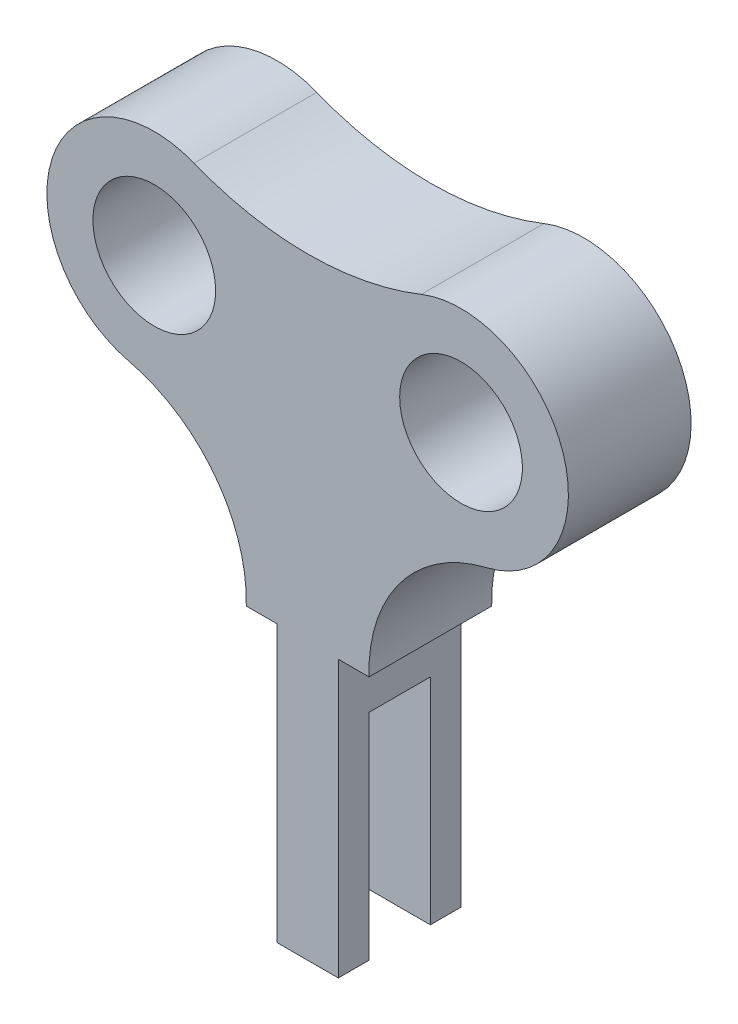
ISO-10303-21;
HEADER;
FILE_DESCRIPTION(('STEP AP214'),'2;1');
FILE_NAME('part.step','',(''),(''),'','','');
FILE_SCHEMA(('AUTOMOTIVE_DESIGN { 1 0 10303 214 1 1 1 1 }'));
ENDSEC;
DATA;
#1=APPLICATION_CONTEXT('core data for automotive mechanical design processes');
#2=APPLICATION_PROTOCOL_DEFINITION('international standard','automotive_design',2000,#1);
#3=PRODUCT_CONTEXT('',#1,'mechanical');
#4=PRODUCT('Part','Part','',(#3));
#5=PRODUCT_RELATED_PRODUCT_CATEGORY('part','',(#4));
#6=PRODUCT_DEFINITION_FORMATION('','',#4);
#7=PRODUCT_DEFINITION_CONTEXT('part definition',#1,'design');
#8=PRODUCT_DEFINITION('design','',#6,#7);
#9=PRODUCT_DEFINITION_SHAPE('','',#8);
#10=(LENGTH_UNIT() NAMED_UNIT(*) SI_UNIT(.MILLI.,.METRE.));
#11=(NAMED_UNIT(*) PLANE_ANGLE_UNIT() SI_UNIT($,.RADIAN.));
#12=(NAMED_UNIT(*) SI_UNIT($,.STERADIAN.) SOLID_ANGLE_UNIT());
#13=UNCERTAINTY_MEASURE_WITH_UNIT(LENGTH_MEASURE(1.E-05),#10,'distance_accuracy_value','');
#14=(GEOMETRIC_REPRESENTATION_CONTEXT(3) GLOBAL_UNCERTAINTY_ASSIGNED_CONTEXT((#13)) GLOBAL_UNIT_ASSIGNED_CONTEXT((#10,
#11,#12)) REPRESENTATION_CONTEXT('',''));
#15=CARTESIAN_POINT('',(0.,0.,0.));
#16=DIRECTION('',(0.,0.,1.));
#17=DIRECTION('',(1.,0.,0.));
#18=AXIS2_PLACEMENT_3D('',#15,#16,#17);
#19=CARTESIAN_POINT('',(-5.,-22.5,20.));
#20=DIRECTION('',(0.,1.,0.));
#21=DIRECTION('',(0.,0.,1.));
#22=AXIS2_PLACEMENT_3D('',#19,#20,#21);
#23=PLANE('',#22);
#24=DIRECTION('',(0.,0.,-1.));
#25=VECTOR('',#24,1.);
#26=CARTESIAN_POINT('',(-5.,-22.5,20.));
#27=LINE('',#26,#25);
#28=CARTESIAN_POINT('',(-5.,-22.5,20.));
#29=VERTEX_POINT('',#28);
#30=CARTESIAN_POINT('',(-5.,-22.5,15.));
#31=VERTEX_POINT('',#30);
#32=EDGE_CURVE('E145',#29,#31,#27,.T.);
#33=ORIENTED_EDGE('',*,*,#32,.T.);
#34=DIRECTION('',(1.,0.,0.));
#35=VECTOR('',#34,1.);
#36=CARTESIAN_POINT('',(-42.5,-22.5,15.));
#37=LINE('',#36,#35);
#38=CARTESIAN_POINT('',(5.,-22.5,15.));
#39=VERTEX_POINT('',#38);
#40=EDGE_CURVE('E269',#31,#39,#37,.T.);
#41=ORIENTED_EDGE('',*,*,#40,.T.);
#42=DIRECTION('',(0.,0.,-1.));
#43=VECTOR('',#42,1.);
#44=CARTESIAN_POINT('',(5.,-22.5,20.));
#45=LINE('',#44,#43);
#46=CARTESIAN_POINT('',(5.,-22.5,20.));
#47=VERTEX_POINT('',#46);
#48=EDGE_CURVE('E157',#47,#39,#45,.T.);
#49=ORIENTED_EDGE('',*,*,#48,.F.);
#50=DIRECTION('',(1.,0.,0.));
#51=VECTOR('',#50,1.);
#52=CARTESIAN_POINT('',(-5.,-22.5,20.));
#53=LINE('',#52,#51);
#54=EDGE_CURVE('E134',#29,#47,#53,.T.);
#55=ORIENTED_EDGE('',*,*,#54,.F.);
#56=EDGE_LOOP('',(#33,#41,#49,#55));
#57=FACE_BOUND('',#56,.T.);
#58=ADVANCED_FACE('F38',(#57),#23,.F.);
#59=CARTESIAN_POINT('',(5.,22.5,20.));
#60=DIRECTION('',(0.,1.,0.));
#61=DIRECTION('',(0.,0.,1.));
#62=AXIS2_PLACEMENT_3D('',#59,#60,#61);
#63=PLANE('',#62);
#64=DIRECTION('',(1.,0.,0.));
#65=VECTOR('',#64,1.);
#66=CARTESIAN_POINT('',(5.,22.5,0.));
#67=LINE('',#66,#65);
#68=CARTESIAN_POINT('',(5.,22.5,0.));
#69=VERTEX_POINT('',#68);
#70=CARTESIAN_POINT('',(10.,22.5,0.));
#71=VERTEX_POINT('',#70);
#72=EDGE_CURVE('E165',#69,#71,#67,.T.);
#73=ORIENTED_EDGE('',*,*,#72,.T.);
#74=DIRECTION('',(0.,0.,-1.));
#75=VECTOR('',#74,1.);
#76=CARTESIAN_POINT('',(10.,22.5,20.));
#77=LINE('',#76,#75);
#78=CARTESIAN_POINT('',(10.,22.5,20.));
#79=VERTEX_POINT('',#78);
#80=EDGE_CURVE('E11',#79,#71,#77,.T.);
#81=ORIENTED_EDGE('',*,*,#80,.F.);
#82=DIRECTION('',(1.,0.,0.));
#83=VECTOR('',#82,1.);
#84=CARTESIAN_POINT('',(5.,22.5,20.));
#85=LINE('',#84,#83);
#86=CARTESIAN_POINT('',(5.,22.5,20.));
#87=VERTEX_POINT('',#86);
#88=EDGE_CURVE('E197',#87,#79,#85,.T.);
#89=ORIENTED_EDGE('',*,*,#88,.F.);
#90=DIRECTION('',(0.,0.,-1.));
#91=VECTOR('',#90,1.);
#92=CARTESIAN_POINT('',(5.,22.5,20.));
#93=LINE('',#92,#91);
#94=EDGE_CURVE('E161',#87,#69,#93,.T.);
#95=ORIENTED_EDGE('',*,*,#94,.T.);
#96=EDGE_LOOP('',(#73,#81,#89,#95));
#97=FACE_BOUND('',#96,.T.);
#98=ADVANCED_FACE('F40',(#97),#63,.F.);
#99=CARTESIAN_POINT('',(34.990451034251,23.1909103449104,20.));
#100=DIRECTION('',(0.,0.,-1.));
#101=DIRECTION('',(-1.,0.,0.));
#102=AXIS2_PLACEMENT_3D('',#99,#100,#101);
#103=CYLINDRICAL_SURFACE('',#102,25.);
#104=CARTESIAN_POINT('',(34.990451034251,23.1909103449104,0.));
#105=DIRECTION('',(0.,0.,-1.));
#106=DIRECTION('',(1.,0.,0.));
#107=AXIS2_PLACEMENT_3D('',#104,#105,#106);
#108=CIRCLE('',#107,25.);
#109=CARTESIAN_POINT('',(29.1137151317504,47.4903748479043,0.));
#110=VERTEX_POINT('',#109);
#111=EDGE_CURVE('E169',#71,#110,#108,.T.);
#112=ORIENTED_EDGE('',*,*,#111,.T.);
#113=DIRECTION('',(0.,0.,-1.));
#114=VECTOR('',#113,1.);
#115=CARTESIAN_POINT('',(29.1137151317504,47.4903748479043,20.));
#116=LINE('',#115,#114);
#117=CARTESIAN_POINT('',(29.1137151317504,47.4903748479043,20.));
#118=VERTEX_POINT('',#117);
#119=EDGE_CURVE('E47',#118,#110,#116,.T.);
#120=ORIENTED_EDGE('',*,*,#119,.F.);
#121=CARTESIAN_POINT('',(34.990451034251,23.1909103449104,20.));
#122=DIRECTION('',(0.,0.,-1.));
#123=DIRECTION('',(1.,0.,0.));
#124=AXIS2_PLACEMENT_3D('',#121,#122,#123);
#125=CIRCLE('',#124,25.);
#126=EDGE_CURVE('E109',#79,#118,#125,.T.);
#127=ORIENTED_EDGE('',*,*,#126,.F.);
#128=ORIENTED_EDGE('',*,*,#80,.T.);
#129=EDGE_LOOP('',(#112,#120,#127,#128));
#130=FACE_BOUND('',#129,.T.);
#131=ADVANCED_FACE('F342',(#130),#103,.F.);
#132=CARTESIAN_POINT('',(25.,64.5,20.));
#133=DIRECTION('',(0.,0.,-1.));
#134=DIRECTION('',(-1.,0.,0.));
#135=AXIS2_PLACEMENT_3D('',#132,#133,#134);
#136=CYLINDRICAL_SURFACE('',#135,17.5);
#137=CARTESIAN_POINT('',(25.,64.5,0.));
#138=DIRECTION('',(0.,0.,1.));
#139=DIRECTION('',(1.,0.,0.));
#140=AXIS2_PLACEMENT_3D('',#137,#138,#139);
#141=CIRCLE('',#140,17.5);
#142=CARTESIAN_POINT('',(18.5185185185185,80.7554728570169,0.));
#143=VERTEX_POINT('',#142);
#144=EDGE_CURVE('E172',#110,#143,#141,.T.);
#145=ORIENTED_EDGE('',*,*,#144,.T.);
#146=DIRECTION('',(0.,0.,-1.));
#147=VECTOR('',#146,1.);
#148=CARTESIAN_POINT('',(18.5185185185185,80.7554728570169,20.));
#149=LINE('',#148,#147);
#150=CARTESIAN_POINT('',(18.5185185185185,80.7554728570169,20.));
#151=VERTEX_POINT('',#150);
#152=EDGE_CURVE('E217',#151,#143,#149,.T.);
#153=ORIENTED_EDGE('',*,*,#152,.F.);
#154=CARTESIAN_POINT('',(25.,64.5,20.));
#155=DIRECTION('',(0.,0.,1.));
#156=DIRECTION('',(1.,0.,0.));
#157=AXIS2_PLACEMENT_3D('',#154,#155,#156);
#158=CIRCLE('',#157,17.5);
#159=EDGE_CURVE('E227',#118,#151,#158,.T.);
#160=ORIENTED_EDGE('',*,*,#159,.F.);
#161=ORIENTED_EDGE('',*,*,#119,.T.);
#162=EDGE_LOOP('',(#145,#153,#160,#161));
#163=FACE_BOUND('',#162,.T.);
#164=ADVANCED_FACE('F225',(#163),#136,.T.);
#165=CARTESIAN_POINT('',(0.,127.199681019922,20.));
#166=DIRECTION('',(0.,0.,-1.));
#167=DIRECTION('',(-1.,0.,0.));
#168=AXIS2_PLACEMENT_3D('',#165,#166,#167);
#169=CYLINDRICAL_SURFACE('',#168,50.);
#170=CARTESIAN_POINT('',(0.,127.199681019922,0.));
#171=DIRECTION('',(0.,0.,-1.));
#172=DIRECTION('',(1.,0.,0.));
#173=AXIS2_PLACEMENT_3D('',#170,#171,#172);
#174=CIRCLE('',#173,50.);
#175=CARTESIAN_POINT('',(-18.5185185185185,80.7554728570169,0.));
#176=VERTEX_POINT('',#175);
#177=EDGE_CURVE('E175',#143,#176,#174,.T.);
#178=ORIENTED_EDGE('',*,*,#177,.T.);
#179=DIRECTION('',(0.,0.,-1.));
#180=VECTOR('',#179,1.);
#181=CARTESIAN_POINT('',(-18.5185185185185,80.7554728570169,20.));
#182=LINE('',#181,#180);
#183=CARTESIAN_POINT('',(-18.5185185185185,80.7554728570169,20.));
#184=VERTEX_POINT('',#183);
#185=EDGE_CURVE('E213',#184,#176,#182,.T.);
#186=ORIENTED_EDGE('',*,*,#185,.F.);
#187=CARTESIAN_POINT('',(0.,127.199681019922,20.));
#188=DIRECTION('',(0.,0.,-1.));
#189=DIRECTION('',(1.,0.,0.));
#190=AXIS2_PLACEMENT_3D('',#187,#188,#189);
#191=CIRCLE('',#190,50.);
#192=EDGE_CURVE('E246',#151,#184,#191,.T.);
#193=ORIENTED_EDGE('',*,*,#192,.F.);
#194=ORIENTED_EDGE('',*,*,#152,.T.);
#195=EDGE_LOOP('',(#178,#186,#193,#194));
#196=FACE_BOUND('',#195,.T.);
#197=ADVANCED_FACE('F236',(#196),#169,.F.);
#198=CARTESIAN_POINT('',(-25.,64.5,20.));
#199=DIRECTION('',(0.,0.,-1.));
#200=DIRECTION('',(-1.,0.,0.));
#201=AXIS2_PLACEMENT_3D('',#198,#199,#200);
#202=CYLINDRICAL_SURFACE('',#201,17.5);
#203=CARTESIAN_POINT('',(-25.,64.5,0.));
#204=DIRECTION('',(0.,0.,1.));
#205=DIRECTION('',(1.,0.,0.));
#206=AXIS2_PLACEMENT_3D('',#203,#204,#205);
#207=CIRCLE('',#206,17.5);
#208=CARTESIAN_POINT('',(-29.1137151317504,47.4903748479043,0.));
#209=VERTEX_POINT('',#208);
#210=EDGE_CURVE('E178',#176,#209,#207,.T.);
#211=ORIENTED_EDGE('',*,*,#210,.T.);
#212=DIRECTION('',(0.,0.,-1.));
#213=VECTOR('',#212,1.);
#214=CARTESIAN_POINT('',(-29.1137151317504,47.4903748479043,20.));
#215=LINE('',#214,#213);
#216=CARTESIAN_POINT('',(-29.1137151317504,47.4903748479043,20.));
#217=VERTEX_POINT('',#216);
#218=EDGE_CURVE('E209',#217,#209,#215,.T.);
#219=ORIENTED_EDGE('',*,*,#218,.F.);
#220=CARTESIAN_POINT('',(-25.,64.5,20.));
#221=DIRECTION('',(0.,0.,1.));
#222=DIRECTION('',(1.,0.,0.));
#223=AXIS2_PLACEMENT_3D('',#220,#221,#222);
#224=CIRCLE('',#223,17.5);
#225=EDGE_CURVE('E242',#184,#217,#224,.T.);
#226=ORIENTED_EDGE('',*,*,#225,.F.);
#227=ORIENTED_EDGE('',*,*,#185,.T.);
#228=EDGE_LOOP('',(#211,#219,#226,#227));
#229=FACE_BOUND('',#228,.T.);
#230=ADVANCED_FACE('F240',(#229),#202,.T.);
#231=CARTESIAN_POINT('',(-34.990451034251,23.1909103449104,20.));
#232=DIRECTION('',(0.,0.,-1.));
#233=DIRECTION('',(-1.,0.,0.));
#234=AXIS2_PLACEMENT_3D('',#231,#232,#233);
#235=CYLINDRICAL_SURFACE('',#234,25.);
#236=CARTESIAN_POINT('',(-34.990451034251,23.1909103449104,0.));
#237=DIRECTION('',(0.,0.,-1.));
#238=DIRECTION('',(1.,0.,0.));
#239=AXIS2_PLACEMENT_3D('',#236,#237,#238);
#240=CIRCLE('',#239,25.);
#241=CARTESIAN_POINT('',(-10.,22.5,0.));
#242=VERTEX_POINT('',#241);
#243=EDGE_CURVE('E181',#209,#242,#240,.T.);
#244=ORIENTED_EDGE('',*,*,#243,.T.);
#245=DIRECTION('',(0.,0.,-1.));
#246=VECTOR('',#245,1.);
#247=CARTESIAN_POINT('',(-10.,22.5,20.));
#248=LINE('',#247,#246);
#249=CARTESIAN_POINT('',(-10.,22.5,20.));
#250=VERTEX_POINT('',#249);
#251=EDGE_CURVE('E205',#250,#242,#248,.T.);
#252=ORIENTED_EDGE('',*,*,#251,.F.);
#253=CARTESIAN_POINT('',(-34.990451034251,23.1909103449104,20.));
#254=DIRECTION('',(0.,0.,-1.));
#255=DIRECTION('',(1.,0.,0.));
#256=AXIS2_PLACEMENT_3D('',#253,#254,#255);
#257=CIRCLE('',#256,25.);
#258=EDGE_CURVE('E245',#217,#250,#257,.T.);
#259=ORIENTED_EDGE('',*,*,#258,.F.);
#260=ORIENTED_EDGE('',*,*,#218,.T.);
#261=EDGE_LOOP('',(#244,#252,#259,#260));
#262=FACE_BOUND('',#261,.T.);
#263=ADVANCED_FACE('F451',(#262),#235,.F.);
#264=CARTESIAN_POINT('',(-5.,22.5,20.));
#265=DIRECTION('',(0.,1.,0.));
#266=DIRECTION('',(0.,0.,1.));
#267=AXIS2_PLACEMENT_3D('',#264,#265,#266);
#268=PLANE('',#267);
#269=DIRECTION('',(1.,0.,0.));
#270=VECTOR('',#269,1.);
#271=CARTESIAN_POINT('',(-5.,22.5,0.));
#272=LINE('',#271,#270);
#273=CARTESIAN_POINT('',(-5.,22.5,0.));
#274=VERTEX_POINT('',#273);
#275=EDGE_CURVE('E184',#242,#274,#272,.T.);
#276=ORIENTED_EDGE('',*,*,#275,.T.);
#277=DIRECTION('',(0.,0.,-1.));
#278=VECTOR('',#277,1.);
#279=CARTESIAN_POINT('',(-5.,22.5,20.));
#280=LINE('',#279,#278);
#281=CARTESIAN_POINT('',(-5.,22.5,20.));
#282=VERTEX_POINT('',#281);
#283=EDGE_CURVE('E153',#282,#274,#280,.T.);
#284=ORIENTED_EDGE('',*,*,#283,.F.);
#285=DIRECTION('',(1.,0.,0.));
#286=VECTOR('',#285,1.);
#287=CARTESIAN_POINT('',(-5.,22.5,20.));
#288=LINE('',#287,#286);
#289=EDGE_CURVE('E137',#250,#282,#288,.T.);
#290=ORIENTED_EDGE('',*,*,#289,.F.);
#291=ORIENTED_EDGE('',*,*,#251,.T.);
#292=EDGE_LOOP('',(#276,#284,#290,#291));
#293=FACE_BOUND('',#292,.T.);
#294=ADVANCED_FACE('F353',(#293),#268,.F.);
#295=CARTESIAN_POINT('',(-5.,-22.5,20.));
#296=DIRECTION('',(1.,0.,0.));
#297=DIRECTION('',(0.,0.,-1.));
#298=AXIS2_PLACEMENT_3D('',#295,#296,#297);
#299=PLANE('',#298);
#300=DIRECTION('',(0.,0.,1.));
#301=VECTOR('',#300,1.);
#302=CARTESIAN_POINT('',(-5.,12.5,20.));
#303=LINE('',#302,#301);
#304=CARTESIAN_POINT('',(-5.,12.5,5.));
#305=VERTEX_POINT('',#304);
#306=CARTESIAN_POINT('',(-5.,12.5,15.));
#307=VERTEX_POINT('',#306);
#308=EDGE_CURVE('E262',#305,#307,#303,.T.);
#309=ORIENTED_EDGE('',*,*,#308,.T.);
#310=DIRECTION('',(0.,-1.,0.));
#311=VECTOR('',#310,1.);
#312=CARTESIAN_POINT('',(-5.,-22.5,15.));
#313=LINE('',#312,#311);
#314=EDGE_CURVE('E149',#307,#31,#313,.T.);
#315=ORIENTED_EDGE('',*,*,#314,.T.);
#316=ORIENTED_EDGE('',*,*,#32,.F.);
#317=DIRECTION('',(0.,-1.,0.));
#318=VECTOR('',#317,1.);
#319=CARTESIAN_POINT('',(-5.,-22.5,20.));
#320=LINE('',#319,#318);
#321=EDGE_CURVE('E130',#282,#29,#320,.T.);
#322=ORIENTED_EDGE('',*,*,#321,.F.);
#323=ORIENTED_EDGE('',*,*,#283,.T.);
#324=DIRECTION('',(0.,-1.,0.));
#325=VECTOR('',#324,1.);
#326=CARTESIAN_POINT('',(-5.,-22.5,0.));
#327=LINE('',#326,#325);
#328=CARTESIAN_POINT('',(-5.,-22.5,0.));
#329=VERTEX_POINT('',#328);
#330=EDGE_CURVE('E187',#274,#329,#327,.T.);
#331=ORIENTED_EDGE('',*,*,#330,.T.);
#332=CARTESIAN_POINT('',(-5.,-22.5,5.));
#333=VERTEX_POINT('',#332);
#334=EDGE_CURVE('E154',#333,#329,#27,.T.);
#335=ORIENTED_EDGE('',*,*,#334,.F.);
#336=DIRECTION('',(0.,1.,0.));
#337=VECTOR('',#336,1.);
#338=CARTESIAN_POINT('',(-5.,-22.5,5.));
#339=LINE('',#338,#337);
#340=EDGE_CURVE('E265',#333,#305,#339,.T.);
#341=ORIENTED_EDGE('',*,*,#340,.T.);
#342=EDGE_LOOP('',(#309,#315,#316,#322,#323,#331,#335,#341));
#343=FACE_BOUND('',#342,.T.);
#344=ADVANCED_FACE('F147',(#343),#299,.F.);
#345=CARTESIAN_POINT('',(5.,-22.5,5.));
#346=VERTEX_POINT('',#345);
#347=CARTESIAN_POINT('',(5.,-22.5,0.));
#348=VERTEX_POINT('',#347);
#349=EDGE_CURVE('E200',#346,#348,#45,.T.);
#350=ORIENTED_EDGE('',*,*,#349,.F.);
#351=DIRECTION('',(1.,0.,0.));
#352=VECTOR('',#351,1.);
#353=CARTESIAN_POINT('',(-42.5,-22.5,5.));
#354=LINE('',#353,#352);
#355=EDGE_CURVE('E54',#333,#346,#354,.T.);
#356=ORIENTED_EDGE('',*,*,#355,.F.);
#357=ORIENTED_EDGE('',*,*,#334,.T.);
#358=DIRECTION('',(1.,0.,0.));
#359=VECTOR('',#358,1.);
#360=CARTESIAN_POINT('',(-5.,-22.5,0.));
#361=LINE('',#360,#359);
#362=EDGE_CURVE('E191',#329,#348,#361,.T.);
#363=ORIENTED_EDGE('',*,*,#362,.T.);
#364=EDGE_LOOP('',(#350,#356,#357,#363));
#365=FACE_BOUND('',#364,.T.);
#366=ADVANCED_FACE('F338',(#365),#23,.F.);
#367=CARTESIAN_POINT('',(5.,-22.5,20.));
#368=DIRECTION('',(-1.,0.,0.));
#369=DIRECTION('',(0.,0.,1.));
#370=AXIS2_PLACEMENT_3D('',#367,#368,#369);
#371=PLANE('',#370);
#372=ORIENTED_EDGE('',*,*,#48,.T.);
#373=DIRECTION('',(0.,-1.,0.));
#374=VECTOR('',#373,1.);
#375=CARTESIAN_POINT('',(5.,-22.5,15.));
#376=LINE('',#375,#374);
#377=CARTESIAN_POINT('',(5.,12.5,15.));
#378=VERTEX_POINT('',#377);
#379=EDGE_CURVE('E273',#378,#39,#376,.T.);
#380=ORIENTED_EDGE('',*,*,#379,.F.);
#381=DIRECTION('',(0.,0.,1.));
#382=VECTOR('',#381,1.);
#383=CARTESIAN_POINT('',(5.,12.5,15.));
#384=LINE('',#383,#382);
#385=CARTESIAN_POINT('',(5.,12.5,5.));
#386=VERTEX_POINT('',#385);
#387=EDGE_CURVE('E286',#386,#378,#384,.T.);
#388=ORIENTED_EDGE('',*,*,#387,.F.);
#389=DIRECTION('',(0.,1.,0.));
#390=VECTOR('',#389,1.);
#391=CARTESIAN_POINT('',(5.,-22.5,5.));
#392=LINE('',#391,#390);
#393=EDGE_CURVE('E290',#346,#386,#392,.T.);
#394=ORIENTED_EDGE('',*,*,#393,.F.);
#395=ORIENTED_EDGE('',*,*,#349,.T.);
#396=DIRECTION('',(0.,1.,0.));
#397=VECTOR('',#396,1.);
#398=CARTESIAN_POINT('',(5.,-22.5,0.));
#399=LINE('',#398,#397);
#400=EDGE_CURVE('E101',#348,#69,#399,.T.);
#401=ORIENTED_EDGE('',*,*,#400,.T.);
#402=ORIENTED_EDGE('',*,*,#94,.F.);
#403=DIRECTION('',(0.,1.,0.));
#404=VECTOR('',#403,1.);
#405=CARTESIAN_POINT('',(5.,-22.5,20.));
#406=LINE('',#405,#404);
#407=EDGE_CURVE('E63',#47,#87,#406,.T.);
#408=ORIENTED_EDGE('',*,*,#407,.F.);
#409=EDGE_LOOP('',(#372,#380,#388,#394,#395,#401,#402,#408));
#410=FACE_BOUND('',#409,.T.);
#411=ADVANCED_FACE('F347',(#410),#371,.F.);
#412=CARTESIAN_POINT('',(34.990451034251,23.1909103449104,20.));
#413=DIRECTION('',(0.,0.,1.));
#414=DIRECTION('',(1.,0.,0.));
#415=AXIS2_PLACEMENT_3D('',#412,#413,#414);
#416=PLANE('',#415);
#417=CARTESIAN_POINT('',(25.,64.5,20.));
#418=DIRECTION('',(0.,0.,-1.));
#419=DIRECTION('',(-1.,0.,0.));
#420=AXIS2_PLACEMENT_3D('',#417,#418,#419);
#421=CIRCLE('',#420,10.);
#422=CARTESIAN_POINT('',(15.,64.5,20.));
#423=VERTEX_POINT('',#422);
#424=EDGE_CURVE('E293',#423,#423,#421,.T.);
#425=ORIENTED_EDGE('',*,*,#424,.T.);
#426=EDGE_LOOP('',(#425));
#427=FACE_BOUND('',#426,.T.);
#428=CARTESIAN_POINT('',(-25.,64.5,20.));
#429=DIRECTION('',(0.,0.,-1.));
#430=DIRECTION('',(-1.,0.,0.));
#431=AXIS2_PLACEMENT_3D('',#428,#429,#430);
#432=CIRCLE('',#431,10.);
#433=CARTESIAN_POINT('',(-35.,64.5,20.));
#434=VERTEX_POINT('',#433);
#435=EDGE_CURVE('E294',#434,#434,#432,.T.);
#436=ORIENTED_EDGE('',*,*,#435,.T.);
#437=EDGE_LOOP('',(#436));
#438=FACE_BOUND('',#437,.T.);
#439=ORIENTED_EDGE('',*,*,#88,.T.);
#440=ORIENTED_EDGE('',*,*,#126,.T.);
#441=ORIENTED_EDGE('',*,*,#159,.T.);
#442=ORIENTED_EDGE('',*,*,#192,.T.);
#443=ORIENTED_EDGE('',*,*,#225,.T.);
#444=ORIENTED_EDGE('',*,*,#258,.T.);
#445=ORIENTED_EDGE('',*,*,#289,.T.);
#446=ORIENTED_EDGE('',*,*,#321,.T.);
#447=ORIENTED_EDGE('',*,*,#54,.T.);
#448=ORIENTED_EDGE('',*,*,#407,.T.);
#449=EDGE_LOOP('',(#439,#440,#441,#442,#443,#444,#445,#446,#447,#448));
#450=FACE_BOUND('',#449,.T.);
#451=ADVANCED_FACE('F132',(#427,#438,#450),#416,.T.);
#452=CARTESIAN_POINT('',(34.990451034251,23.1909103449104,0.));
#453=DIRECTION('',(0.,0.,1.));
#454=DIRECTION('',(1.,0.,0.));
#455=AXIS2_PLACEMENT_3D('',#452,#453,#454);
#456=PLANE('',#455);
#457=CARTESIAN_POINT('',(25.,64.5,0.));
#458=DIRECTION('',(0.,0.,-1.));
#459=DIRECTION('',(-1.,0.,0.));
#460=AXIS2_PLACEMENT_3D('',#457,#458,#459);
#461=CIRCLE('',#460,10.);
#462=CARTESIAN_POINT('',(15.,64.5,0.));
#463=VERTEX_POINT('',#462);
#464=EDGE_CURVE('E302',#463,#463,#461,.T.);
#465=ORIENTED_EDGE('',*,*,#464,.F.);
#466=EDGE_LOOP('',(#465));
#467=FACE_BOUND('',#466,.T.);
#468=CARTESIAN_POINT('',(-25.,64.5,0.));
#469=DIRECTION('',(0.,0.,-1.));
#470=DIRECTION('',(-1.,0.,0.));
#471=AXIS2_PLACEMENT_3D('',#468,#469,#470);
#472=CIRCLE('',#471,10.);
#473=CARTESIAN_POINT('',(-35.,64.5,0.));
#474=VERTEX_POINT('',#473);
#475=EDGE_CURVE('E298',#474,#474,#472,.T.);
#476=ORIENTED_EDGE('',*,*,#475,.F.);
#477=EDGE_LOOP('',(#476));
#478=FACE_BOUND('',#477,.T.);
#479=ORIENTED_EDGE('',*,*,#72,.F.);
#480=ORIENTED_EDGE('',*,*,#400,.F.);
#481=ORIENTED_EDGE('',*,*,#362,.F.);
#482=ORIENTED_EDGE('',*,*,#330,.F.);
#483=ORIENTED_EDGE('',*,*,#275,.F.);
#484=ORIENTED_EDGE('',*,*,#243,.F.);
#485=ORIENTED_EDGE('',*,*,#210,.F.);
#486=ORIENTED_EDGE('',*,*,#177,.F.);
#487=ORIENTED_EDGE('',*,*,#144,.F.);
#488=ORIENTED_EDGE('',*,*,#111,.F.);
#489=EDGE_LOOP('',(#479,#480,#481,#482,#483,#484,#485,#486,#487,#488));
#490=FACE_BOUND('',#489,.T.);
#491=ADVANCED_FACE('F231',(#467,#478,#490),#456,.F.);
#492=CARTESIAN_POINT('',(-42.5,-22.5,15.));
#493=DIRECTION('',(0.,0.,1.));
#494=DIRECTION('',(1.,0.,0.));
#495=AXIS2_PLACEMENT_3D('',#492,#493,#494);
#496=PLANE('',#495);
#497=DIRECTION('',(1.,0.,0.));
#498=VECTOR('',#497,1.);
#499=CARTESIAN_POINT('',(-42.5,12.5,15.));
#500=LINE('',#499,#498);
#501=EDGE_CURVE('E277',#307,#378,#500,.T.);
#502=ORIENTED_EDGE('',*,*,#501,.T.);
#503=ORIENTED_EDGE('',*,*,#379,.T.);
#504=ORIENTED_EDGE('',*,*,#40,.F.);
#505=ORIENTED_EDGE('',*,*,#314,.F.);
#506=EDGE_LOOP('',(#502,#503,#504,#505));
#507=FACE_BOUND('',#506,.T.);
#508=ADVANCED_FACE('F321',(#507),#496,.F.);
#509=CARTESIAN_POINT('',(-42.5,12.5,15.));
#510=DIRECTION('',(0.,1.,0.));
#511=DIRECTION('',(0.,0.,1.));
#512=AXIS2_PLACEMENT_3D('',#509,#510,#511);
#513=PLANE('',#512);
#514=DIRECTION('',(1.,0.,0.));
#515=VECTOR('',#514,1.);
#516=CARTESIAN_POINT('',(-42.5,12.5,5.));
#517=LINE('',#516,#515);
#518=EDGE_CURVE('E272',#305,#386,#517,.T.);
#519=ORIENTED_EDGE('',*,*,#518,.T.);
#520=ORIENTED_EDGE('',*,*,#387,.T.);
#521=ORIENTED_EDGE('',*,*,#501,.F.);
#522=ORIENTED_EDGE('',*,*,#308,.F.);
#523=EDGE_LOOP('',(#519,#520,#521,#522));
#524=FACE_BOUND('',#523,.T.);
#525=ADVANCED_FACE('F332',(#524),#513,.F.);
#526=CARTESIAN_POINT('',(-42.5,-22.5,5.));
#527=DIRECTION('',(0.,0.,-1.));
#528=DIRECTION('',(-1.,0.,0.));
#529=AXIS2_PLACEMENT_3D('',#526,#527,#528);
#530=PLANE('',#529);
#531=ORIENTED_EDGE('',*,*,#355,.T.);
#532=ORIENTED_EDGE('',*,*,#393,.T.);
#533=ORIENTED_EDGE('',*,*,#518,.F.);
#534=ORIENTED_EDGE('',*,*,#340,.F.);
#535=EDGE_LOOP('',(#531,#532,#533,#534));
#536=FACE_BOUND('',#535,.T.);
#537=ADVANCED_FACE('F326',(#536),#530,.F.);
#538=CARTESIAN_POINT('',(-25.,64.5,20.));
#539=DIRECTION('',(0.,0.,-1.));
#540=DIRECTION('',(-1.,0.,0.));
#541=AXIS2_PLACEMENT_3D('',#538,#539,#540);
#542=CYLINDRICAL_SURFACE('',#541,10.);
#543=ORIENTED_EDGE('',*,*,#435,.F.);
#544=EDGE_LOOP('',(#543));
#545=FACE_BOUND('',#544,.T.);
#546=ORIENTED_EDGE('',*,*,#475,.T.);
#547=EDGE_LOOP('',(#546));
#548=FACE_BOUND('',#547,.T.);
#549=ADVANCED_FACE('F315',(#545,#548),#542,.F.);
#550=CARTESIAN_POINT('',(25.,64.5,20.));
#551=DIRECTION('',(0.,0.,-1.));
#552=DIRECTION('',(-1.,0.,0.));
#553=AXIS2_PLACEMENT_3D('',#550,#551,#552);
#554=CYLINDRICAL_SURFACE('',#553,10.);
#555=ORIENTED_EDGE('',*,*,#424,.F.);
#556=EDGE_LOOP('',(#555));
#557=FACE_BOUND('',#556,.T.);
#558=ORIENTED_EDGE('',*,*,#464,.T.);
#559=EDGE_LOOP('',(#558));
#560=FACE_BOUND('',#559,.T.);
#561=ADVANCED_FACE('F312',(#557,#560),#554,.F.);
#562=CLOSED_SHELL('',(#58,#98,#131,#164,#197,#230,#263,#294,#344,#366,#411,#451,#491,#508,#525,
#537,#549,#561));
#563=MANIFOLD_SOLID_BREP('B2',#562);
#564=ADVANCED_BREP_SHAPE_REPRESENTATION('',(#18,#563),#14);
#565=SHAPE_DEFINITION_REPRESENTATION(#9,#564);
ENDSEC;
END-ISO-10303-21;
